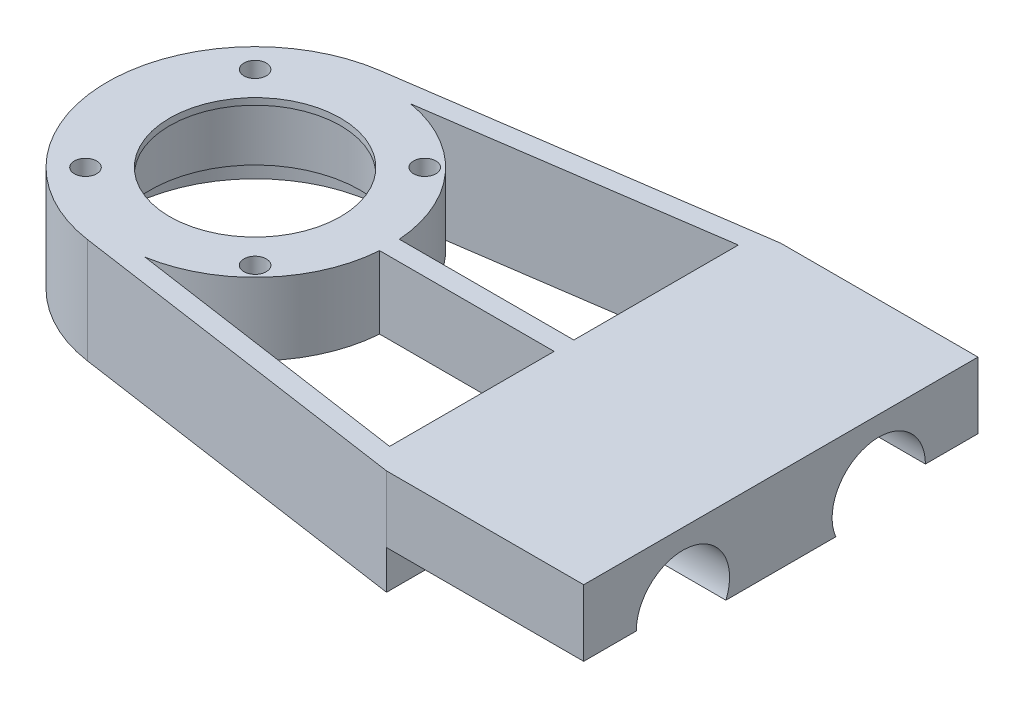
ISO-10303-21;
HEADER;
FILE_DESCRIPTION(('STEP AP214'),'2;1');
FILE_NAME('part.step','',(''),(''),'','','');
FILE_SCHEMA(('AUTOMOTIVE_DESIGN { 1 0 10303 214 1 1 1 1 }'));
ENDSEC;
DATA;
#1=APPLICATION_CONTEXT('core data for automotive mechanical design processes');
#2=APPLICATION_PROTOCOL_DEFINITION('international standard','automotive_design',2000,#1);
#3=PRODUCT_CONTEXT('',#1,'mechanical');
#4=PRODUCT('Part','Part','',(#3));
#5=PRODUCT_RELATED_PRODUCT_CATEGORY('part','',(#4));
#6=PRODUCT_DEFINITION_FORMATION('','',#4);
#7=PRODUCT_DEFINITION_CONTEXT('part definition',#1,'design');
#8=PRODUCT_DEFINITION('design','',#6,#7);
#9=PRODUCT_DEFINITION_SHAPE('','',#8);
#10=(LENGTH_UNIT() NAMED_UNIT(*) SI_UNIT(.MILLI.,.METRE.));
#11=(NAMED_UNIT(*) PLANE_ANGLE_UNIT() SI_UNIT($,.RADIAN.));
#12=(NAMED_UNIT(*) SI_UNIT($,.STERADIAN.) SOLID_ANGLE_UNIT());
#13=UNCERTAINTY_MEASURE_WITH_UNIT(LENGTH_MEASURE(1.E-05),#10,'distance_accuracy_value','');
#14=(GEOMETRIC_REPRESENTATION_CONTEXT(3) GLOBAL_UNCERTAINTY_ASSIGNED_CONTEXT((#13)) GLOBAL_UNIT_ASSIGNED_CONTEXT((#10,
#11,#12)) REPRESENTATION_CONTEXT('',''));
#15=CARTESIAN_POINT('',(0.,0.,0.));
#16=DIRECTION('',(0.,0.,1.));
#17=DIRECTION('',(1.,0.,0.));
#18=AXIS2_PLACEMENT_3D('',#15,#16,#17);
#19=CARTESIAN_POINT('',(-80.,16.,-30.));
#20=DIRECTION('',(0.,-1.,0.));
#21=DIRECTION('',(0.,0.,-1.));
#22=AXIS2_PLACEMENT_3D('',#19,#20,#21);
#23=CYLINDRICAL_SURFACE('',#22,20.5);
#24=CARTESIAN_POINT('',(-80.,16.,-30.));
#25=DIRECTION('',(0.,1.,0.));
#26=DIRECTION('',(0.,0.,-1.));
#27=AXIS2_PLACEMENT_3D('',#24,#25,#26);
#28=CIRCLE('',#27,20.5);
#29=CARTESIAN_POINT('',(-59.5549516997391,16.,-31.5));
#30=VERTEX_POINT('',#29);
#31=CARTESIAN_POINT('',(-76.5446022661524,16.,-50.2066876677233));
#32=VERTEX_POINT('',#31);
#33=EDGE_CURVE('E220',#30,#32,#28,.T.);
#34=ORIENTED_EDGE('',*,*,#33,.F.);
#35=DIRECTION('',(0.,-1.,0.));
#36=VECTOR('',#35,1.);
#37=CARTESIAN_POINT('',(-59.5549516997391,16.,-31.5));
#38=LINE('',#37,#36);
#39=CARTESIAN_POINT('',(-59.5549516997391,5.,-31.5));
#40=VERTEX_POINT('',#39);
#41=EDGE_CURVE('E385',#30,#40,#38,.T.);
#42=ORIENTED_EDGE('',*,*,#41,.T.);
#43=CARTESIAN_POINT('',(-80.,5.,-30.));
#44=DIRECTION('',(0.,1.,0.));
#45=DIRECTION('',(0.,0.,1.));
#46=AXIS2_PLACEMENT_3D('',#43,#44,#45);
#47=CIRCLE('',#46,20.5);
#48=CARTESIAN_POINT('',(-76.5446022661524,5.,-50.2066876677233));
#49=VERTEX_POINT('',#48);
#50=EDGE_CURVE('E302',#49,#40,#47,.F.);
#51=ORIENTED_EDGE('',*,*,#50,.F.);
#52=DIRECTION('',(0.,-1.,0.));
#53=VECTOR('',#52,1.);
#54=CARTESIAN_POINT('',(-76.5446022661524,16.,-50.2066876677233));
#55=LINE('',#54,#53);
#56=EDGE_CURVE('E211',#32,#49,#55,.T.);
#57=ORIENTED_EDGE('',*,*,#56,.F.);
#58=EDGE_LOOP('',(#34,#42,#51,#57));
#59=FACE_BOUND('',#58,.T.);
#60=ADVANCED_FACE('F41',(#59),#23,.T.);
#61=CARTESIAN_POINT('',(0.,16.,0.));
#62=DIRECTION('',(-1.,0.,0.));
#63=DIRECTION('',(0.,0.,1.));
#64=AXIS2_PLACEMENT_3D('',#61,#62,#63);
#65=PLANE('',#64);
#66=DIRECTION('',(0.,0.,-1.));
#67=VECTOR('',#66,1.);
#68=CARTESIAN_POINT('',(0.,5.89999999999999,0.));
#69=LINE('',#68,#67);
#70=CARTESIAN_POINT('',(0.,5.9,-52.));
#71=VERTEX_POINT('',#70);
#72=CARTESIAN_POINT('',(0.,5.90000000000001,-60.));
#73=VERTEX_POINT('',#72);
#74=EDGE_CURVE('E254',#71,#73,#69,.T.);
#75=ORIENTED_EDGE('',*,*,#74,.T.);
#76=DIRECTION('',(0.,-1.,0.));
#77=VECTOR('',#76,1.);
#78=CARTESIAN_POINT('',(0.,16.,-60.));
#79=LINE('',#78,#77);
#80=CARTESIAN_POINT('',(0.,16.,-60.));
#81=VERTEX_POINT('',#80);
#82=EDGE_CURVE('E347',#81,#73,#79,.T.);
#83=ORIENTED_EDGE('',*,*,#82,.F.);
#84=DIRECTION('',(0.,0.,-1.));
#85=VECTOR('',#84,1.);
#86=CARTESIAN_POINT('',(0.,16.,0.));
#87=LINE('',#86,#85);
#88=CARTESIAN_POINT('',(0.,16.,0.));
#89=VERTEX_POINT('',#88);
#90=EDGE_CURVE('E319',#89,#81,#87,.T.);
#91=ORIENTED_EDGE('',*,*,#90,.F.);
#92=DIRECTION('',(0.,-1.,0.));
#93=VECTOR('',#92,1.);
#94=CARTESIAN_POINT('',(0.,16.,0.));
#95=LINE('',#94,#93);
#96=CARTESIAN_POINT('',(0.,5.9,0.));
#97=VERTEX_POINT('',#96);
#98=EDGE_CURVE('E350',#89,#97,#95,.T.);
#99=ORIENTED_EDGE('',*,*,#98,.T.);
#100=DIRECTION('',(0.,0.,1.));
#101=VECTOR('',#100,1.);
#102=CARTESIAN_POINT('',(0.,5.9,0.));
#103=LINE('',#102,#101);
#104=CARTESIAN_POINT('',(0.,5.9,-8.));
#105=VERTEX_POINT('',#104);
#106=EDGE_CURVE('E252',#105,#97,#103,.T.);
#107=ORIENTED_EDGE('',*,*,#106,.F.);
#108=CARTESIAN_POINT('',(0.,5.9,-15.1));
#109=DIRECTION('',(1.,0.,0.));
#110=DIRECTION('',(0.,0.,-1.));
#111=AXIS2_PLACEMENT_3D('',#108,#109,#110);
#112=CIRCLE('',#111,7.1);
#113=CARTESIAN_POINT('',(0.,3.1365613511182,-21.6401381356869));
#114=VERTEX_POINT('',#113);
#115=EDGE_CURVE('E224',#114,#105,#112,.T.);
#116=ORIENTED_EDGE('',*,*,#115,.F.);
#117=DIRECTION('',(0.,0.,-1.));
#118=VECTOR('',#117,1.);
#119=CARTESIAN_POINT('',(0.,3.1365613511182,0.));
#120=LINE('',#119,#118);
#121=CARTESIAN_POINT('',(0.,3.1365613511182,-38.3598618643131));
#122=VERTEX_POINT('',#121);
#123=EDGE_CURVE('E233',#114,#122,#120,.T.);
#124=ORIENTED_EDGE('',*,*,#123,.T.);
#125=CARTESIAN_POINT('',(0.,5.90000000000001,-44.9));
#126=DIRECTION('',(1.,0.,0.));
#127=DIRECTION('',(0.,0.,-1.));
#128=AXIS2_PLACEMENT_3D('',#125,#126,#127);
#129=CIRCLE('',#128,7.09999999999999);
#130=EDGE_CURVE('E257',#122,#71,#129,.F.);
#131=ORIENTED_EDGE('',*,*,#130,.T.);
#132=EDGE_LOOP('',(#75,#83,#91,#99,#107,#116,#124,#131));
#133=FACE_BOUND('',#132,.T.);
#134=ADVANCED_FACE('F406',(#133),#65,.F.);
#135=CARTESIAN_POINT('',(0.,16.,-60.));
#136=DIRECTION('',(0.,0.,1.));
#137=DIRECTION('',(1.,0.,0.));
#138=AXIS2_PLACEMENT_3D('',#135,#136,#137);
#139=PLANE('',#138);
#140=DIRECTION('',(1.,0.,0.));
#141=VECTOR('',#140,1.);
#142=CARTESIAN_POINT('',(-30.,5.90000000000001,-60.));
#143=LINE('',#142,#141);
#144=CARTESIAN_POINT('',(-30.,5.90000000000001,-60.));
#145=VERTEX_POINT('',#144);
#146=EDGE_CURVE('E269',#145,#73,#143,.T.);
#147=ORIENTED_EDGE('',*,*,#146,.F.);
#148=DIRECTION('',(0.,-1.,0.));
#149=VECTOR('',#148,1.);
#150=CARTESIAN_POINT('',(-30.,16.,-60.));
#151=LINE('',#150,#149);
#152=CARTESIAN_POINT('',(-30.,16.,-60.));
#153=VERTEX_POINT('',#152);
#154=EDGE_CURVE('E344',#153,#145,#151,.T.);
#155=ORIENTED_EDGE('',*,*,#154,.F.);
#156=DIRECTION('',(-1.,0.,0.));
#157=VECTOR('',#156,1.);
#158=CARTESIAN_POINT('',(0.,16.,-60.));
#159=LINE('',#158,#157);
#160=EDGE_CURVE('E322',#81,#153,#159,.T.);
#161=ORIENTED_EDGE('',*,*,#160,.F.);
#162=ORIENTED_EDGE('',*,*,#82,.T.);
#163=EDGE_LOOP('',(#147,#155,#161,#162));
#164=FACE_BOUND('',#163,.T.);
#165=ADVANCED_FACE('F411',(#164),#139,.F.);
#166=CARTESIAN_POINT('',(-80.,0.,-30.));
#167=DIRECTION('',(0.,1.,0.));
#168=DIRECTION('',(0.,0.,1.));
#169=AXIS2_PLACEMENT_3D('',#166,#167,#168);
#170=PLANE('',#169);
#171=CARTESIAN_POINT('',(-80.,0.,-30.));
#172=DIRECTION('',(0.,-1.,0.));
#173=DIRECTION('',(0.,0.,-1.));
#174=AXIS2_PLACEMENT_3D('',#171,#172,#173);
#175=CIRCLE('',#174,20.5);
#176=CARTESIAN_POINT('',(-76.5446022661524,0.,-9.79331233227669));
#177=VERTEX_POINT('',#176);
#178=CARTESIAN_POINT('',(-76.5446022661524,0.,-50.2066876677233));
#179=VERTEX_POINT('',#178);
#180=EDGE_CURVE('E298',#177,#179,#175,.T.);
#181=ORIENTED_EDGE('',*,*,#180,.F.);
#182=DIRECTION('',(-0.989611573211398,0.,-0.143766943926838));
#183=VECTOR('',#182,1.);
#184=CARTESIAN_POINT('',(-76.5446022661524,0.,-9.79331233227669));
#185=LINE('',#184,#183);
#186=CARTESIAN_POINT('',(-33.,0.,-3.46732084048448));
#187=VERTEX_POINT('',#186);
#188=EDGE_CURVE('E218',#187,#177,#185,.T.);
#189=ORIENTED_EDGE('',*,*,#188,.F.);
#190=DIRECTION('',(0.,0.,1.));
#191=VECTOR('',#190,1.);
#192=CARTESIAN_POINT('',(-33.,0.,-3.46732084048448));
#193=LINE('',#192,#191);
#194=CARTESIAN_POINT('',(-33.,0.,-56.5326791595155));
#195=VERTEX_POINT('',#194);
#196=EDGE_CURVE('E215',#195,#187,#193,.T.);
#197=ORIENTED_EDGE('',*,*,#196,.F.);
#198=DIRECTION('',(0.989611573211398,0.,-0.143766943926838));
#199=VECTOR('',#198,1.);
#200=CARTESIAN_POINT('',(-33.,0.,-56.5326791595155));
#201=LINE('',#200,#199);
#202=EDGE_CURVE('E212',#179,#195,#201,.T.);
#203=ORIENTED_EDGE('',*,*,#202,.F.);
#204=EDGE_LOOP('',(#181,#189,#197,#203));
#205=FACE_BOUND('',#204,.T.);
#206=DIRECTION('',(0.,0.,-1.));
#207=VECTOR('',#206,1.);
#208=CARTESIAN_POINT('',(-30.,0.,0.));
#209=LINE('',#208,#207);
#210=CARTESIAN_POINT('',(-30.,0.,0.));
#211=VERTEX_POINT('',#210);
#212=CARTESIAN_POINT('',(-30.,0.,-60.));
#213=VERTEX_POINT('',#212);
#214=EDGE_CURVE('E238',#211,#213,#209,.T.);
#215=ORIENTED_EDGE('',*,*,#214,.F.);
#216=DIRECTION('',(0.989611573211398,0.,0.143766943926838));
#217=VECTOR('',#216,1.);
#218=CARTESIAN_POINT('',(-30.,0.,0.));
#219=LINE('',#218,#217);
#220=CARTESIAN_POINT('',(-83.2347562383539,0.,-7.73373960274354));
#221=VERTEX_POINT('',#220);
#222=EDGE_CURVE('E320',#221,#211,#219,.T.);
#223=ORIENTED_EDGE('',*,*,#222,.F.);
#224=CARTESIAN_POINT('',(-80.,0.,-30.));
#225=DIRECTION('',(0.,1.,0.));
#226=DIRECTION('',(0.,0.,1.));
#227=AXIS2_PLACEMENT_3D('',#224,#225,#226);
#228=CIRCLE('',#227,22.5);
#229=CARTESIAN_POINT('',(-83.2347562383539,0.,-52.2662603972564));
#230=VERTEX_POINT('',#229);
#231=EDGE_CURVE('E332',#230,#221,#228,.T.);
#232=ORIENTED_EDGE('',*,*,#231,.F.);
#233=DIRECTION('',(-0.989611573211397,0.,0.143766943926838));
#234=VECTOR('',#233,1.);
#235=CARTESIAN_POINT('',(-30.,0.,-60.));
#236=LINE('',#235,#234);
#237=EDGE_CURVE('E315',#213,#230,#236,.T.);
#238=ORIENTED_EDGE('',*,*,#237,.F.);
#239=EDGE_LOOP('',(#215,#223,#232,#238));
#240=FACE_BOUND('',#239,.T.);
#241=ADVANCED_FACE('F375',(#205,#240),#170,.F.);
#242=CARTESIAN_POINT('',(0.,16.,0.));
#243=DIRECTION('',(0.,0.,-1.));
#244=DIRECTION('',(-1.,0.,0.));
#245=AXIS2_PLACEMENT_3D('',#242,#243,#244);
#246=PLANE('',#245);
#247=DIRECTION('',(0.,-1.,0.));
#248=VECTOR('',#247,1.);
#249=CARTESIAN_POINT('',(-30.,16.,0.));
#250=LINE('',#249,#248);
#251=CARTESIAN_POINT('',(-30.,16.,0.));
#252=VERTEX_POINT('',#251);
#253=CARTESIAN_POINT('',(-30.,5.9,0.));
#254=VERTEX_POINT('',#253);
#255=EDGE_CURVE('E330',#252,#254,#250,.T.);
#256=ORIENTED_EDGE('',*,*,#255,.T.);
#257=DIRECTION('',(1.,0.,0.));
#258=VECTOR('',#257,1.);
#259=CARTESIAN_POINT('',(-30.,5.9,0.));
#260=LINE('',#259,#258);
#261=EDGE_CURVE('E271',#254,#97,#260,.T.);
#262=ORIENTED_EDGE('',*,*,#261,.T.);
#263=ORIENTED_EDGE('',*,*,#98,.F.);
#264=DIRECTION('',(1.,0.,0.));
#265=VECTOR('',#264,1.);
#266=CARTESIAN_POINT('',(0.,16.,0.));
#267=LINE('',#266,#265);
#268=EDGE_CURVE('E316',#252,#89,#267,.T.);
#269=ORIENTED_EDGE('',*,*,#268,.F.);
#270=EDGE_LOOP('',(#256,#262,#263,#269));
#271=FACE_BOUND('',#270,.T.);
#272=ADVANCED_FACE('F43',(#271),#246,.F.);
#273=CARTESIAN_POINT('',(-30.,16.,-60.));
#274=DIRECTION('',(0.143766943926839,0.,0.989611573211398));
#275=DIRECTION('',(0.989611573211398,0.,-0.143766943926839));
#276=AXIS2_PLACEMENT_3D('',#273,#274,#275);
#277=PLANE('',#276);
#278=ORIENTED_EDGE('',*,*,#237,.T.);
#279=DIRECTION('',(0.,-1.,0.));
#280=VECTOR('',#279,1.);
#281=CARTESIAN_POINT('',(-83.2347562383539,16.,-52.2662603972564));
#282=LINE('',#281,#280);
#283=CARTESIAN_POINT('',(-83.2347562383539,16.,-52.2662603972564));
#284=VERTEX_POINT('',#283);
#285=EDGE_CURVE('E341',#284,#230,#282,.T.);
#286=ORIENTED_EDGE('',*,*,#285,.F.);
#287=DIRECTION('',(-0.989611573211397,0.,0.143766943926838));
#288=VECTOR('',#287,1.);
#289=CARTESIAN_POINT('',(-30.,16.,-60.));
#290=LINE('',#289,#288);
#291=EDGE_CURVE('E324',#153,#284,#290,.T.);
#292=ORIENTED_EDGE('',*,*,#291,.F.);
#293=ORIENTED_EDGE('',*,*,#154,.T.);
#294=DIRECTION('',(0.,1.,0.));
#295=VECTOR('',#294,1.);
#296=CARTESIAN_POINT('',(-30.,0.,-60.));
#297=LINE('',#296,#295);
#298=EDGE_CURVE('E240',#213,#145,#297,.T.);
#299=ORIENTED_EDGE('',*,*,#298,.F.);
#300=EDGE_LOOP('',(#278,#286,#292,#293,#299));
#301=FACE_BOUND('',#300,.T.);
#302=ADVANCED_FACE('F489',(#301),#277,.F.);
#303=CARTESIAN_POINT('',(-80.,16.,-30.));
#304=DIRECTION('',(0.,-1.,0.));
#305=DIRECTION('',(0.,0.,-1.));
#306=AXIS2_PLACEMENT_3D('',#303,#304,#305);
#307=CYLINDRICAL_SURFACE('',#306,22.5);
#308=ORIENTED_EDGE('',*,*,#231,.T.);
#309=DIRECTION('',(0.,-1.,0.));
#310=VECTOR('',#309,1.);
#311=CARTESIAN_POINT('',(-83.2347562383539,16.,-7.73373960274354));
#312=LINE('',#311,#310);
#313=CARTESIAN_POINT('',(-83.2347562383539,16.,-7.73373960274354));
#314=VERTEX_POINT('',#313);
#315=EDGE_CURVE('E338',#314,#221,#312,.T.);
#316=ORIENTED_EDGE('',*,*,#315,.F.);
#317=CARTESIAN_POINT('',(-80.,16.,-30.));
#318=DIRECTION('',(0.,1.,0.));
#319=DIRECTION('',(0.,0.,1.));
#320=AXIS2_PLACEMENT_3D('',#317,#318,#319);
#321=CIRCLE('',#320,22.5);
#322=EDGE_CURVE('E326',#284,#314,#321,.T.);
#323=ORIENTED_EDGE('',*,*,#322,.F.);
#324=ORIENTED_EDGE('',*,*,#285,.T.);
#325=EDGE_LOOP('',(#308,#316,#323,#324));
#326=FACE_BOUND('',#325,.T.);
#327=ADVANCED_FACE('F485',(#326),#307,.T.);
#328=CARTESIAN_POINT('',(-30.,16.,0.));
#329=DIRECTION('',(0.143766943926838,0.,-0.989611573211398));
#330=DIRECTION('',(-0.989611573211398,0.,-0.143766943926838));
#331=AXIS2_PLACEMENT_3D('',#328,#329,#330);
#332=PLANE('',#331);
#333=ORIENTED_EDGE('',*,*,#222,.T.);
#334=DIRECTION('',(0.,-1.,0.));
#335=VECTOR('',#334,1.);
#336=CARTESIAN_POINT('',(-30.,0.,0.));
#337=LINE('',#336,#335);
#338=EDGE_CURVE('E236',#254,#211,#337,.T.);
#339=ORIENTED_EDGE('',*,*,#338,.F.);
#340=ORIENTED_EDGE('',*,*,#255,.F.);
#341=DIRECTION('',(0.989611573211398,0.,0.143766943926838));
#342=VECTOR('',#341,1.);
#343=CARTESIAN_POINT('',(-30.,16.,0.));
#344=LINE('',#343,#342);
#345=EDGE_CURVE('E328',#314,#252,#344,.T.);
#346=ORIENTED_EDGE('',*,*,#345,.F.);
#347=ORIENTED_EDGE('',*,*,#315,.T.);
#348=EDGE_LOOP('',(#333,#339,#340,#346,#347));
#349=FACE_BOUND('',#348,.T.);
#350=ADVANCED_FACE('F480',(#349),#332,.F.);
#351=CARTESIAN_POINT('',(-80.,16.,-30.));
#352=DIRECTION('',(0.,1.,0.));
#353=DIRECTION('',(0.,0.,1.));
#354=AXIS2_PLACEMENT_3D('',#351,#352,#353);
#355=PLANE('',#354);
#356=DIRECTION('',(1.,0.,0.));
#357=VECTOR('',#356,1.);
#358=CARTESIAN_POINT('',(-59.5549516997391,16.,-31.5));
#359=LINE('',#358,#357);
#360=CARTESIAN_POINT('',(-33.,16.,-31.5));
#361=VERTEX_POINT('',#360);
#362=EDGE_CURVE('E185',#30,#361,#359,.T.);
#363=ORIENTED_EDGE('',*,*,#362,.F.);
#364=ORIENTED_EDGE('',*,*,#33,.T.);
#365=DIRECTION('',(0.989611573211398,0.,-0.143766943926838));
#366=VECTOR('',#365,1.);
#367=CARTESIAN_POINT('',(-33.,16.,-56.5326791595155));
#368=LINE('',#367,#366);
#369=CARTESIAN_POINT('',(-33.,16.,-56.5326791595155));
#370=VERTEX_POINT('',#369);
#371=EDGE_CURVE('E202',#32,#370,#368,.T.);
#372=ORIENTED_EDGE('',*,*,#371,.T.);
#373=DIRECTION('',(0.,0.,1.));
#374=VECTOR('',#373,1.);
#375=CARTESIAN_POINT('',(-33.,16.,-3.46732084048448));
#376=LINE('',#375,#374);
#377=EDGE_CURVE('E201',#370,#361,#376,.T.);
#378=ORIENTED_EDGE('',*,*,#377,.T.);
#379=EDGE_LOOP('',(#363,#364,#372,#378));
#380=FACE_BOUND('',#379,.T.);
#381=CARTESIAN_POINT('',(-76.5446022661524,16.,-9.79331233227669));
#382=VERTEX_POINT('',#381);
#383=CARTESIAN_POINT('',(-59.5549516997391,16.,-28.5));
#384=VERTEX_POINT('',#383);
#385=EDGE_CURVE('E195',#382,#384,#28,.T.);
#386=ORIENTED_EDGE('',*,*,#385,.T.);
#387=DIRECTION('',(-1.,0.,0.));
#388=VECTOR('',#387,1.);
#389=CARTESIAN_POINT('',(-59.5549516997391,16.,-28.5));
#390=LINE('',#389,#388);
#391=CARTESIAN_POINT('',(-33.,16.,-28.5));
#392=VERTEX_POINT('',#391);
#393=EDGE_CURVE('E179',#392,#384,#390,.T.);
#394=ORIENTED_EDGE('',*,*,#393,.F.);
#395=CARTESIAN_POINT('',(-33.,16.,-3.46732084048448));
#396=VERTEX_POINT('',#395);
#397=EDGE_CURVE('E192',#392,#396,#376,.T.);
#398=ORIENTED_EDGE('',*,*,#397,.T.);
#399=DIRECTION('',(-0.989611573211398,0.,-0.143766943926838));
#400=VECTOR('',#399,1.);
#401=CARTESIAN_POINT('',(-76.5446022661524,16.,-9.79331233227669));
#402=LINE('',#401,#400);
#403=EDGE_CURVE('E205',#396,#382,#402,.T.);
#404=ORIENTED_EDGE('',*,*,#403,.T.);
#405=EDGE_LOOP('',(#386,#394,#398,#404));
#406=FACE_BOUND('',#405,.T.);
#407=CARTESIAN_POINT('',(-92.9046987566545,16.,-17.0953012433455));
#408=DIRECTION('',(0.,-1.,0.));
#409=DIRECTION('',(0.,0.,-1.));
#410=AXIS2_PLACEMENT_3D('',#407,#408,#409);
#411=CIRCLE('',#410,1.69999999999999);
#412=CARTESIAN_POINT('',(-92.9046987566545,16.,-18.7953012433455));
#413=VERTEX_POINT('',#412);
#414=EDGE_CURVE('E277',#413,#413,#411,.T.);
#415=ORIENTED_EDGE('',*,*,#414,.T.);
#416=EDGE_LOOP('',(#415));
#417=FACE_BOUND('',#416,.T.);
#418=CARTESIAN_POINT('',(-67.0953012433455,16.,-17.0953012433455));
#419=DIRECTION('',(0.,-1.,0.));
#420=DIRECTION('',(0.,0.,-1.));
#421=AXIS2_PLACEMENT_3D('',#418,#419,#420);
#422=CIRCLE('',#421,1.69999999999999);
#423=CARTESIAN_POINT('',(-67.0953012433455,16.,-18.7953012433455));
#424=VERTEX_POINT('',#423);
#425=EDGE_CURVE('E283',#424,#424,#422,.T.);
#426=ORIENTED_EDGE('',*,*,#425,.T.);
#427=EDGE_LOOP('',(#426));
#428=FACE_BOUND('',#427,.T.);
#429=CARTESIAN_POINT('',(-67.0953012433456,16.,-42.9046987566545));
#430=DIRECTION('',(0.,-1.,0.));
#431=DIRECTION('',(0.,0.,-1.));
#432=AXIS2_PLACEMENT_3D('',#429,#430,#431);
#433=CIRCLE('',#432,1.69999999999999);
#434=CARTESIAN_POINT('',(-67.0953012433456,16.,-44.6046987566545));
#435=VERTEX_POINT('',#434);
#436=EDGE_CURVE('E289',#435,#435,#433,.T.);
#437=ORIENTED_EDGE('',*,*,#436,.T.);
#438=EDGE_LOOP('',(#437));
#439=FACE_BOUND('',#438,.T.);
#440=CARTESIAN_POINT('',(-92.9046987566543,16.,-42.9046987566543));
#441=DIRECTION('',(0.,-1.,0.));
#442=DIRECTION('',(0.,0.,-1.));
#443=AXIS2_PLACEMENT_3D('',#440,#441,#442);
#444=CIRCLE('',#443,1.69999999999999);
#445=CARTESIAN_POINT('',(-92.9046987566543,16.,-44.6046987566543));
#446=VERTEX_POINT('',#445);
#447=EDGE_CURVE('E295',#446,#446,#444,.T.);
#448=ORIENTED_EDGE('',*,*,#447,.T.);
#449=EDGE_LOOP('',(#448));
#450=FACE_BOUND('',#449,.T.);
#451=CARTESIAN_POINT('',(-80.,16.,-30.));
#452=DIRECTION('',(0.,-1.,0.));
#453=DIRECTION('',(0.,0.,-1.));
#454=AXIS2_PLACEMENT_3D('',#451,#452,#453);
#455=CIRCLE('',#454,13.);
#456=CARTESIAN_POINT('',(-80.,16.,-43.));
#457=VERTEX_POINT('',#456);
#458=EDGE_CURVE('E306',#457,#457,#455,.T.);
#459=ORIENTED_EDGE('',*,*,#458,.T.);
#460=EDGE_LOOP('',(#459));
#461=FACE_BOUND('',#460,.T.);
#462=ORIENTED_EDGE('',*,*,#268,.T.);
#463=ORIENTED_EDGE('',*,*,#90,.T.);
#464=ORIENTED_EDGE('',*,*,#160,.T.);
#465=ORIENTED_EDGE('',*,*,#291,.T.);
#466=ORIENTED_EDGE('',*,*,#322,.T.);
#467=ORIENTED_EDGE('',*,*,#345,.T.);
#468=EDGE_LOOP('',(#462,#463,#464,#465,#466,#467));
#469=FACE_BOUND('',#468,.T.);
#470=ADVANCED_FACE('F189',(#380,#406,#417,#428,#439,#450,#461,#469),#355,.T.);
#471=CARTESIAN_POINT('',(-80.,15.,-30.));
#472=DIRECTION('',(0.,1.,0.));
#473=DIRECTION('',(0.,0.,1.));
#474=AXIS2_PLACEMENT_3D('',#471,#472,#473);
#475=PLANE('',#474);
#476=CARTESIAN_POINT('',(-80.,15.,-30.));
#477=DIRECTION('',(0.,-1.,0.));
#478=DIRECTION('',(0.,0.,-1.));
#479=AXIS2_PLACEMENT_3D('',#476,#477,#478);
#480=CIRCLE('',#479,13.);
#481=CARTESIAN_POINT('',(-80.,15.,-43.));
#482=VERTEX_POINT('',#481);
#483=EDGE_CURVE('E310',#482,#482,#480,.T.);
#484=ORIENTED_EDGE('',*,*,#483,.F.);
#485=EDGE_LOOP('',(#484));
#486=FACE_BOUND('',#485,.T.);
#487=CARTESIAN_POINT('',(-80.,15.,-30.));
#488=DIRECTION('',(0.,1.,0.));
#489=DIRECTION('',(0.,0.,1.));
#490=AXIS2_PLACEMENT_3D('',#487,#488,#489);
#491=CIRCLE('',#490,16.);
#492=CARTESIAN_POINT('',(-80.,15.,-14.));
#493=VERTEX_POINT('',#492);
#494=EDGE_CURVE('E309',#493,#493,#491,.F.);
#495=ORIENTED_EDGE('',*,*,#494,.T.);
#496=EDGE_LOOP('',(#495));
#497=FACE_BOUND('',#496,.T.);
#498=ADVANCED_FACE('F473',(#486,#497),#475,.F.);
#499=CARTESIAN_POINT('',(-80.,61.254833995939,-30.));
#500=DIRECTION('',(0.,-1.,0.));
#501=DIRECTION('',(0.,0.,-1.));
#502=AXIS2_PLACEMENT_3D('',#499,#500,#501);
#503=CYLINDRICAL_SURFACE('',#502,16.);
#504=CARTESIAN_POINT('',(-80.,5.,-30.));
#505=DIRECTION('',(0.,1.,0.));
#506=DIRECTION('',(0.,0.,1.));
#507=AXIS2_PLACEMENT_3D('',#504,#505,#506);
#508=CIRCLE('',#507,16.);
#509=CARTESIAN_POINT('',(-80.,5.,-14.));
#510=VERTEX_POINT('',#509);
#511=EDGE_CURVE('E304',#510,#510,#508,.F.);
#512=ORIENTED_EDGE('',*,*,#511,.T.);
#513=EDGE_LOOP('',(#512));
#514=FACE_BOUND('',#513,.T.);
#515=ORIENTED_EDGE('',*,*,#494,.F.);
#516=EDGE_LOOP('',(#515));
#517=FACE_BOUND('',#516,.T.);
#518=ADVANCED_FACE('F469',(#514,#517),#503,.F.);
#519=CARTESIAN_POINT('',(-80.,16.,-30.));
#520=DIRECTION('',(0.,-1.,0.));
#521=DIRECTION('',(0.,0.,-1.));
#522=AXIS2_PLACEMENT_3D('',#519,#520,#521);
#523=CYLINDRICAL_SURFACE('',#522,13.);
#524=ORIENTED_EDGE('',*,*,#458,.F.);
#525=EDGE_LOOP('',(#524));
#526=FACE_BOUND('',#525,.T.);
#527=ORIENTED_EDGE('',*,*,#483,.T.);
#528=EDGE_LOOP('',(#527));
#529=FACE_BOUND('',#528,.T.);
#530=ADVANCED_FACE('F465',(#526,#529),#523,.F.);
#531=CARTESIAN_POINT('',(-80.,5.,-30.));
#532=DIRECTION('',(0.,1.,0.));
#533=DIRECTION('',(0.,0.,1.));
#534=AXIS2_PLACEMENT_3D('',#531,#532,#533);
#535=PLANE('',#534);
#536=CARTESIAN_POINT('',(-92.9046987566545,5.,-17.0953012433455));
#537=DIRECTION('',(0.,-1.,0.));
#538=DIRECTION('',(0.,0.,-1.));
#539=AXIS2_PLACEMENT_3D('',#536,#537,#538);
#540=CIRCLE('',#539,1.69999999999999);
#541=CARTESIAN_POINT('',(-92.9046987566545,5.,-18.7953012433455));
#542=VERTEX_POINT('',#541);
#543=EDGE_CURVE('E264',#542,#542,#540,.T.);
#544=ORIENTED_EDGE('',*,*,#543,.F.);
#545=EDGE_LOOP('',(#544));
#546=FACE_BOUND('',#545,.T.);
#547=CARTESIAN_POINT('',(-67.0953012433455,5.,-17.0953012433455));
#548=DIRECTION('',(0.,-1.,0.));
#549=DIRECTION('',(0.,0.,-1.));
#550=AXIS2_PLACEMENT_3D('',#547,#548,#549);
#551=CIRCLE('',#550,1.69999999999999);
#552=CARTESIAN_POINT('',(-67.0953012433455,5.,-18.7953012433455));
#553=VERTEX_POINT('',#552);
#554=EDGE_CURVE('E280',#553,#553,#551,.T.);
#555=ORIENTED_EDGE('',*,*,#554,.F.);
#556=EDGE_LOOP('',(#555));
#557=FACE_BOUND('',#556,.T.);
#558=CARTESIAN_POINT('',(-67.0953012433456,5.,-42.9046987566545));
#559=DIRECTION('',(0.,-1.,0.));
#560=DIRECTION('',(0.,0.,-1.));
#561=AXIS2_PLACEMENT_3D('',#558,#559,#560);
#562=CIRCLE('',#561,1.69999999999999);
#563=CARTESIAN_POINT('',(-67.0953012433456,5.,-44.6046987566545));
#564=VERTEX_POINT('',#563);
#565=EDGE_CURVE('E286',#564,#564,#562,.T.);
#566=ORIENTED_EDGE('',*,*,#565,.F.);
#567=EDGE_LOOP('',(#566));
#568=FACE_BOUND('',#567,.T.);
#569=CARTESIAN_POINT('',(-92.9046987566543,5.,-42.9046987566543));
#570=DIRECTION('',(0.,-1.,0.));
#571=DIRECTION('',(0.,0.,-1.));
#572=AXIS2_PLACEMENT_3D('',#569,#570,#571);
#573=CIRCLE('',#572,1.69999999999999);
#574=CARTESIAN_POINT('',(-92.9046987566543,5.,-44.6046987566543));
#575=VERTEX_POINT('',#574);
#576=EDGE_CURVE('E292',#575,#575,#573,.T.);
#577=ORIENTED_EDGE('',*,*,#576,.F.);
#578=EDGE_LOOP('',(#577));
#579=FACE_BOUND('',#578,.T.);
#580=ORIENTED_EDGE('',*,*,#50,.T.);
#581=DIRECTION('',(1.,0.,0.));
#582=VECTOR('',#581,1.);
#583=CARTESIAN_POINT('',(-59.5549516997391,5.,-31.5));
#584=LINE('',#583,#582);
#585=CARTESIAN_POINT('',(-33.,5.,-31.5));
#586=VERTEX_POINT('',#585);
#587=EDGE_CURVE('E62',#40,#586,#584,.T.);
#588=ORIENTED_EDGE('',*,*,#587,.T.);
#589=DIRECTION('',(0.,0.,1.));
#590=VECTOR('',#589,1.);
#591=CARTESIAN_POINT('',(-33.,5.,-28.5));
#592=LINE('',#591,#590);
#593=CARTESIAN_POINT('',(-33.,5.,-28.5));
#594=VERTEX_POINT('',#593);
#595=EDGE_CURVE('E393',#586,#594,#592,.T.);
#596=ORIENTED_EDGE('',*,*,#595,.T.);
#597=DIRECTION('',(-1.,0.,0.));
#598=VECTOR('',#597,1.);
#599=CARTESIAN_POINT('',(-59.5549516997391,5.,-28.5));
#600=LINE('',#599,#598);
#601=CARTESIAN_POINT('',(-59.5549516997391,5.,-28.5));
#602=VERTEX_POINT('',#601);
#603=EDGE_CURVE('E56',#594,#602,#600,.T.);
#604=ORIENTED_EDGE('',*,*,#603,.T.);
#605=CARTESIAN_POINT('',(-76.5446022661524,5.,-9.79331233227669));
#606=VERTEX_POINT('',#605);
#607=EDGE_CURVE('E305',#602,#606,#47,.F.);
#608=ORIENTED_EDGE('',*,*,#607,.T.);
#609=EDGE_CURVE('E301',#606,#49,#47,.F.);
#610=ORIENTED_EDGE('',*,*,#609,.T.);
#611=EDGE_LOOP('',(#580,#588,#596,#604,#608,#610));
#612=FACE_BOUND('',#611,.T.);
#613=ORIENTED_EDGE('',*,*,#511,.F.);
#614=EDGE_LOOP('',(#613));
#615=FACE_BOUND('',#614,.T.);
#616=ADVANCED_FACE('F362',(#546,#557,#568,#579,#612,#615),#535,.F.);
#617=CARTESIAN_POINT('',(-80.,72.9827560572969,-30.));
#618=DIRECTION('',(0.,-1.,0.));
#619=DIRECTION('',(0.,0.,-1.));
#620=AXIS2_PLACEMENT_3D('',#617,#618,#619);
#621=CYLINDRICAL_SURFACE('',#620,20.5);
#622=ORIENTED_EDGE('',*,*,#609,.F.);
#623=DIRECTION('',(0.,-1.,0.));
#624=VECTOR('',#623,1.);
#625=CARTESIAN_POINT('',(-76.5446022661524,72.9827560572969,-9.79331233227669));
#626=LINE('',#625,#624);
#627=EDGE_CURVE('E13',#606,#177,#626,.T.);
#628=ORIENTED_EDGE('',*,*,#627,.T.);
#629=ORIENTED_EDGE('',*,*,#180,.T.);
#630=DIRECTION('',(0.,-1.,0.));
#631=VECTOR('',#630,1.);
#632=CARTESIAN_POINT('',(-76.5446022661524,72.9827560572969,-50.2066876677233));
#633=LINE('',#632,#631);
#634=EDGE_CURVE('E49',#179,#49,#633,.F.);
#635=ORIENTED_EDGE('',*,*,#634,.T.);
#636=EDGE_LOOP('',(#622,#628,#629,#635));
#637=FACE_BOUND('',#636,.T.);
#638=ADVANCED_FACE('F358',(#637),#621,.F.);
#639=CARTESIAN_POINT('',(-92.9046987566543,5.,-42.9046987566543));
#640=DIRECTION('',(0.,-1.,0.));
#641=DIRECTION('',(0.,0.,-1.));
#642=AXIS2_PLACEMENT_3D('',#639,#640,#641);
#643=CYLINDRICAL_SURFACE('',#642,1.69999999999999);
#644=ORIENTED_EDGE('',*,*,#447,.F.);
#645=EDGE_LOOP('',(#644));
#646=FACE_BOUND('',#645,.T.);
#647=ORIENTED_EDGE('',*,*,#576,.T.);
#648=EDGE_LOOP('',(#647));
#649=FACE_BOUND('',#648,.T.);
#650=ADVANCED_FACE('F456',(#646,#649),#643,.F.);
#651=CARTESIAN_POINT('',(-67.0953012433456,5.,-42.9046987566545));
#652=DIRECTION('',(0.,-1.,0.));
#653=DIRECTION('',(0.,0.,-1.));
#654=AXIS2_PLACEMENT_3D('',#651,#652,#653);
#655=CYLINDRICAL_SURFACE('',#654,1.69999999999999);
#656=ORIENTED_EDGE('',*,*,#436,.F.);
#657=EDGE_LOOP('',(#656));
#658=FACE_BOUND('',#657,.T.);
#659=ORIENTED_EDGE('',*,*,#565,.T.);
#660=EDGE_LOOP('',(#659));
#661=FACE_BOUND('',#660,.T.);
#662=ADVANCED_FACE('F452',(#658,#661),#655,.F.);
#663=CARTESIAN_POINT('',(-67.0953012433455,5.,-17.0953012433455));
#664=DIRECTION('',(0.,-1.,0.));
#665=DIRECTION('',(0.,0.,-1.));
#666=AXIS2_PLACEMENT_3D('',#663,#664,#665);
#667=CYLINDRICAL_SURFACE('',#666,1.69999999999999);
#668=ORIENTED_EDGE('',*,*,#425,.F.);
#669=EDGE_LOOP('',(#668));
#670=FACE_BOUND('',#669,.T.);
#671=ORIENTED_EDGE('',*,*,#554,.T.);
#672=EDGE_LOOP('',(#671));
#673=FACE_BOUND('',#672,.T.);
#674=ADVANCED_FACE('F448',(#670,#673),#667,.F.);
#675=CARTESIAN_POINT('',(-92.9046987566545,5.,-17.0953012433455));
#676=DIRECTION('',(0.,-1.,0.));
#677=DIRECTION('',(0.,0.,-1.));
#678=AXIS2_PLACEMENT_3D('',#675,#676,#677);
#679=CYLINDRICAL_SURFACE('',#678,1.69999999999999);
#680=ORIENTED_EDGE('',*,*,#414,.F.);
#681=EDGE_LOOP('',(#680));
#682=FACE_BOUND('',#681,.T.);
#683=ORIENTED_EDGE('',*,*,#543,.T.);
#684=EDGE_LOOP('',(#683));
#685=FACE_BOUND('',#684,.T.);
#686=ADVANCED_FACE('F444',(#682,#685),#679,.F.);
#687=CARTESIAN_POINT('',(-30.,5.9,-15.1));
#688=DIRECTION('',(1.,0.,0.));
#689=DIRECTION('',(0.,0.,-1.));
#690=AXIS2_PLACEMENT_3D('',#687,#688,#689);
#691=CYLINDRICAL_SURFACE('',#690,7.1);
#692=ORIENTED_EDGE('',*,*,#115,.T.);
#693=DIRECTION('',(1.,0.,0.));
#694=VECTOR('',#693,1.);
#695=CARTESIAN_POINT('',(-30.,5.9,-8.));
#696=LINE('',#695,#694);
#697=CARTESIAN_POINT('',(-30.,5.9,-8.));
#698=VERTEX_POINT('',#697);
#699=EDGE_CURVE('E249',#698,#105,#696,.T.);
#700=ORIENTED_EDGE('',*,*,#699,.F.);
#701=CARTESIAN_POINT('',(-30.,5.9,-15.1));
#702=DIRECTION('',(1.,0.,0.));
#703=DIRECTION('',(0.,0.,-1.));
#704=AXIS2_PLACEMENT_3D('',#701,#702,#703);
#705=CIRCLE('',#704,7.1);
#706=CARTESIAN_POINT('',(-30.,3.1365613511182,-21.6401381356869));
#707=VERTEX_POINT('',#706);
#708=EDGE_CURVE('E229',#707,#698,#705,.T.);
#709=ORIENTED_EDGE('',*,*,#708,.F.);
#710=DIRECTION('',(1.,0.,0.));
#711=VECTOR('',#710,1.);
#712=CARTESIAN_POINT('',(-30.,3.1365613511182,-21.6401381356869));
#713=LINE('',#712,#711);
#714=EDGE_CURVE('E262',#707,#114,#713,.T.);
#715=ORIENTED_EDGE('',*,*,#714,.T.);
#716=EDGE_LOOP('',(#692,#700,#709,#715));
#717=FACE_BOUND('',#716,.T.);
#718=ADVANCED_FACE('F434',(#717),#691,.F.);
#719=CARTESIAN_POINT('',(-30.,3.1365613511182,0.));
#720=DIRECTION('',(0.,-1.,0.));
#721=DIRECTION('',(0.,0.,-1.));
#722=AXIS2_PLACEMENT_3D('',#719,#720,#721);
#723=PLANE('',#722);
#724=ORIENTED_EDGE('',*,*,#123,.F.);
#725=ORIENTED_EDGE('',*,*,#714,.F.);
#726=DIRECTION('',(0.,0.,-1.));
#727=VECTOR('',#726,1.);
#728=CARTESIAN_POINT('',(-30.,3.1365613511182,0.));
#729=LINE('',#728,#727);
#730=CARTESIAN_POINT('',(-30.,3.1365613511182,-38.3598618643131));
#731=VERTEX_POINT('',#730);
#732=EDGE_CURVE('E247',#707,#731,#729,.T.);
#733=ORIENTED_EDGE('',*,*,#732,.T.);
#734=DIRECTION('',(1.,0.,0.));
#735=VECTOR('',#734,1.);
#736=CARTESIAN_POINT('',(-30.,3.1365613511182,-38.3598618643131));
#737=LINE('',#736,#735);
#738=EDGE_CURVE('E265',#731,#122,#737,.T.);
#739=ORIENTED_EDGE('',*,*,#738,.T.);
#740=EDGE_LOOP('',(#724,#725,#733,#739));
#741=FACE_BOUND('',#740,.T.);
#742=ADVANCED_FACE('F430',(#741),#723,.T.);
#743=CARTESIAN_POINT('',(-30.,5.90000000000001,-44.9));
#744=DIRECTION('',(1.,0.,0.));
#745=DIRECTION('',(0.,0.,-1.));
#746=AXIS2_PLACEMENT_3D('',#743,#744,#745);
#747=CYLINDRICAL_SURFACE('',#746,7.09999999999999);
#748=ORIENTED_EDGE('',*,*,#130,.F.);
#749=ORIENTED_EDGE('',*,*,#738,.F.);
#750=CARTESIAN_POINT('',(-30.,5.90000000000001,-44.9));
#751=DIRECTION('',(1.,0.,0.));
#752=DIRECTION('',(0.,0.,-1.));
#753=AXIS2_PLACEMENT_3D('',#750,#751,#752);
#754=CIRCLE('',#753,7.09999999999999);
#755=CARTESIAN_POINT('',(-30.,5.9,-52.));
#756=VERTEX_POINT('',#755);
#757=EDGE_CURVE('E245',#731,#756,#754,.F.);
#758=ORIENTED_EDGE('',*,*,#757,.T.);
#759=DIRECTION('',(1.,0.,0.));
#760=VECTOR('',#759,1.);
#761=CARTESIAN_POINT('',(-30.,5.9,-52.));
#762=LINE('',#761,#760);
#763=EDGE_CURVE('E267',#756,#71,#762,.T.);
#764=ORIENTED_EDGE('',*,*,#763,.T.);
#765=EDGE_LOOP('',(#748,#749,#758,#764));
#766=FACE_BOUND('',#765,.T.);
#767=ADVANCED_FACE('F433',(#766),#747,.F.);
#768=CARTESIAN_POINT('',(-30.,5.89999999999999,0.));
#769=DIRECTION('',(0.,-1.,0.));
#770=DIRECTION('',(0.,0.,-1.));
#771=AXIS2_PLACEMENT_3D('',#768,#769,#770);
#772=PLANE('',#771);
#773=ORIENTED_EDGE('',*,*,#74,.F.);
#774=ORIENTED_EDGE('',*,*,#763,.F.);
#775=DIRECTION('',(0.,0.,-1.));
#776=VECTOR('',#775,1.);
#777=CARTESIAN_POINT('',(-30.,5.89999999999999,0.));
#778=LINE('',#777,#776);
#779=EDGE_CURVE('E243',#756,#145,#778,.T.);
#780=ORIENTED_EDGE('',*,*,#779,.T.);
#781=ORIENTED_EDGE('',*,*,#146,.T.);
#782=EDGE_LOOP('',(#773,#774,#780,#781));
#783=FACE_BOUND('',#782,.T.);
#784=ADVANCED_FACE('F426',(#783),#772,.T.);
#785=CARTESIAN_POINT('',(-30.,5.9,0.));
#786=DIRECTION('',(0.,1.,0.));
#787=DIRECTION('',(0.,0.,1.));
#788=AXIS2_PLACEMENT_3D('',#785,#786,#787);
#789=PLANE('',#788);
#790=ORIENTED_EDGE('',*,*,#106,.T.);
#791=ORIENTED_EDGE('',*,*,#261,.F.);
#792=DIRECTION('',(0.,0.,1.));
#793=VECTOR('',#792,1.);
#794=CARTESIAN_POINT('',(-30.,5.9,0.));
#795=LINE('',#794,#793);
#796=EDGE_CURVE('E232',#698,#254,#795,.T.);
#797=ORIENTED_EDGE('',*,*,#796,.F.);
#798=ORIENTED_EDGE('',*,*,#699,.T.);
#799=EDGE_LOOP('',(#790,#791,#797,#798));
#800=FACE_BOUND('',#799,.T.);
#801=ADVANCED_FACE('F421',(#800),#789,.F.);
#802=CARTESIAN_POINT('',(-30.,0.,0.));
#803=DIRECTION('',(1.,0.,0.));
#804=DIRECTION('',(0.,0.,-1.));
#805=AXIS2_PLACEMENT_3D('',#802,#803,#804);
#806=PLANE('',#805);
#807=ORIENTED_EDGE('',*,*,#708,.T.);
#808=ORIENTED_EDGE('',*,*,#796,.T.);
#809=ORIENTED_EDGE('',*,*,#338,.T.);
#810=ORIENTED_EDGE('',*,*,#214,.T.);
#811=ORIENTED_EDGE('',*,*,#298,.T.);
#812=ORIENTED_EDGE('',*,*,#779,.F.);
#813=ORIENTED_EDGE('',*,*,#757,.F.);
#814=ORIENTED_EDGE('',*,*,#732,.F.);
#815=EDGE_LOOP('',(#807,#808,#809,#810,#811,#812,#813,#814));
#816=FACE_BOUND('',#815,.T.);
#817=ADVANCED_FACE('F415',(#816),#806,.T.);
#818=ORIENTED_EDGE('',*,*,#607,.F.);
#819=DIRECTION('',(0.,-1.,0.));
#820=VECTOR('',#819,1.);
#821=CARTESIAN_POINT('',(-59.5549516997391,16.,-28.5));
#822=LINE('',#821,#820);
#823=EDGE_CURVE('E184',#384,#602,#822,.T.);
#824=ORIENTED_EDGE('',*,*,#823,.F.);
#825=ORIENTED_EDGE('',*,*,#385,.F.);
#826=DIRECTION('',(0.,-1.,0.));
#827=VECTOR('',#826,1.);
#828=CARTESIAN_POINT('',(-76.5446022661524,16.,-9.79331233227669));
#829=LINE('',#828,#827);
#830=EDGE_CURVE('E221',#382,#606,#829,.T.);
#831=ORIENTED_EDGE('',*,*,#830,.T.);
#832=EDGE_LOOP('',(#818,#824,#825,#831));
#833=FACE_BOUND('',#832,.T.);
#834=ADVANCED_FACE('F371',(#833),#23,.T.);
#835=CARTESIAN_POINT('',(-76.5446022661524,16.,-9.79331233227669));
#836=DIRECTION('',(-0.143766943926838,0.,0.989611573211398));
#837=DIRECTION('',(0.989611573211398,0.,0.143766943926838));
#838=AXIS2_PLACEMENT_3D('',#835,#836,#837);
#839=PLANE('',#838);
#840=ORIENTED_EDGE('',*,*,#188,.T.);
#841=ORIENTED_EDGE('',*,*,#627,.F.);
#842=ORIENTED_EDGE('',*,*,#830,.F.);
#843=ORIENTED_EDGE('',*,*,#403,.F.);
#844=DIRECTION('',(0.,-1.,0.));
#845=VECTOR('',#844,1.);
#846=CARTESIAN_POINT('',(-33.,16.,-3.46732084048448));
#847=LINE('',#846,#845);
#848=EDGE_CURVE('E199',#396,#187,#847,.T.);
#849=ORIENTED_EDGE('',*,*,#848,.T.);
#850=EDGE_LOOP('',(#840,#841,#842,#843,#849));
#851=FACE_BOUND('',#850,.T.);
#852=ADVANCED_FACE('F369',(#851),#839,.F.);
#853=CARTESIAN_POINT('',(-33.,16.,-3.46732084048448));
#854=DIRECTION('',(1.,0.,0.));
#855=DIRECTION('',(0.,0.,-1.));
#856=AXIS2_PLACEMENT_3D('',#853,#854,#855);
#857=PLANE('',#856);
#858=ORIENTED_EDGE('',*,*,#595,.F.);
#859=DIRECTION('',(0.,-1.,0.));
#860=VECTOR('',#859,1.);
#861=CARTESIAN_POINT('',(-33.,16.,-31.5));
#862=LINE('',#861,#860);
#863=EDGE_CURVE('E216',#361,#586,#862,.T.);
#864=ORIENTED_EDGE('',*,*,#863,.F.);
#865=ORIENTED_EDGE('',*,*,#377,.F.);
#866=DIRECTION('',(0.,-1.,0.));
#867=VECTOR('',#866,1.);
#868=CARTESIAN_POINT('',(-33.,16.,-56.5326791595155));
#869=LINE('',#868,#867);
#870=EDGE_CURVE('E226',#370,#195,#869,.T.);
#871=ORIENTED_EDGE('',*,*,#870,.T.);
#872=ORIENTED_EDGE('',*,*,#196,.T.);
#873=ORIENTED_EDGE('',*,*,#848,.F.);
#874=ORIENTED_EDGE('',*,*,#397,.F.);
#875=DIRECTION('',(0.,-1.,0.));
#876=VECTOR('',#875,1.);
#877=CARTESIAN_POINT('',(-33.,16.,-28.5));
#878=LINE('',#877,#876);
#879=EDGE_CURVE('E176',#392,#594,#878,.T.);
#880=ORIENTED_EDGE('',*,*,#879,.T.);
#881=EDGE_LOOP('',(#858,#864,#865,#871,#872,#873,#874,#880));
#882=FACE_BOUND('',#881,.T.);
#883=ADVANCED_FACE('F197',(#882),#857,.F.);
#884=CARTESIAN_POINT('',(-33.,16.,-56.5326791595155));
#885=DIRECTION('',(-0.143766943926838,0.,-0.989611573211398));
#886=DIRECTION('',(-0.989611573211398,0.,0.143766943926838));
#887=AXIS2_PLACEMENT_3D('',#884,#885,#886);
#888=PLANE('',#887);
#889=ORIENTED_EDGE('',*,*,#202,.T.);
#890=ORIENTED_EDGE('',*,*,#870,.F.);
#891=ORIENTED_EDGE('',*,*,#371,.F.);
#892=ORIENTED_EDGE('',*,*,#56,.T.);
#893=ORIENTED_EDGE('',*,*,#634,.F.);
#894=EDGE_LOOP('',(#889,#890,#891,#892,#893));
#895=FACE_BOUND('',#894,.T.);
#896=ADVANCED_FACE('F377',(#895),#888,.F.);
#897=CARTESIAN_POINT('',(-59.5549516997391,16.,-31.5));
#898=DIRECTION('',(0.,0.,-1.));
#899=DIRECTION('',(-1.,0.,0.));
#900=AXIS2_PLACEMENT_3D('',#897,#898,#899);
#901=PLANE('',#900);
#902=ORIENTED_EDGE('',*,*,#587,.F.);
#903=ORIENTED_EDGE('',*,*,#41,.F.);
#904=ORIENTED_EDGE('',*,*,#362,.T.);
#905=ORIENTED_EDGE('',*,*,#863,.T.);
#906=EDGE_LOOP('',(#902,#903,#904,#905));
#907=FACE_BOUND('',#906,.T.);
#908=ADVANCED_FACE('F396',(#907),#901,.T.);
#909=CARTESIAN_POINT('',(-59.5549516997391,16.,-28.5));
#910=DIRECTION('',(0.,0.,1.));
#911=DIRECTION('',(1.,0.,0.));
#912=AXIS2_PLACEMENT_3D('',#909,#910,#911);
#913=PLANE('',#912);
#914=ORIENTED_EDGE('',*,*,#603,.F.);
#915=ORIENTED_EDGE('',*,*,#879,.F.);
#916=ORIENTED_EDGE('',*,*,#393,.T.);
#917=ORIENTED_EDGE('',*,*,#823,.T.);
#918=EDGE_LOOP('',(#914,#915,#916,#917));
#919=FACE_BOUND('',#918,.T.);
#920=ADVANCED_FACE('F178',(#919),#913,.T.);
#921=CLOSED_SHELL('',(#60,#134,#165,#241,#272,#302,#327,#350,#470,#498,#518,#530,#616,#638,#650,
#662,#674,#686,#718,#742,#767,#784,#801,#817,#834,#852,#883,#896,#908,#920));
#922=MANIFOLD_SOLID_BREP('B2',#921);
#923=ADVANCED_BREP_SHAPE_REPRESENTATION('',(#18,#922),#14);
#924=SHAPE_DEFINITION_REPRESENTATION(#9,#923);
ENDSEC;
END-ISO-10303-21;
